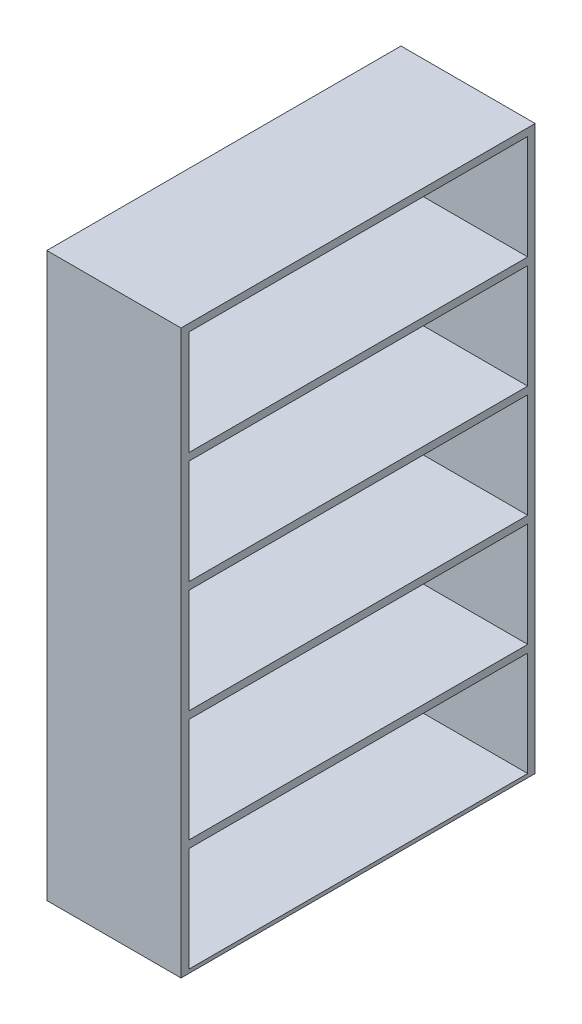
ISO-10303-21;
HEADER;
FILE_DESCRIPTION(('STEP AP214'),'2;1');
FILE_NAME('part.step','',(''),(''),'','','');
FILE_SCHEMA(('AUTOMOTIVE_DESIGN { 1 0 10303 214 1 1 1 1 }'));
ENDSEC;
DATA;
#1=APPLICATION_CONTEXT('core data for automotive mechanical design processes');
#2=APPLICATION_PROTOCOL_DEFINITION('international standard','automotive_design',2000,#1);
#3=PRODUCT_CONTEXT('',#1,'mechanical');
#4=PRODUCT('Part','Part','',(#3));
#5=PRODUCT_RELATED_PRODUCT_CATEGORY('part','',(#4));
#6=PRODUCT_DEFINITION_FORMATION('','',#4);
#7=PRODUCT_DEFINITION_CONTEXT('part definition',#1,'design');
#8=PRODUCT_DEFINITION('design','',#6,#7);
#9=PRODUCT_DEFINITION_SHAPE('','',#8);
#10=(LENGTH_UNIT() NAMED_UNIT(*) SI_UNIT(.MILLI.,.METRE.));
#11=(NAMED_UNIT(*) PLANE_ANGLE_UNIT() SI_UNIT($,.RADIAN.));
#12=(NAMED_UNIT(*) SI_UNIT($,.STERADIAN.) SOLID_ANGLE_UNIT());
#13=UNCERTAINTY_MEASURE_WITH_UNIT(LENGTH_MEASURE(1.E-05),#10,'distance_accuracy_value','');
#14=(GEOMETRIC_REPRESENTATION_CONTEXT(3) GLOBAL_UNCERTAINTY_ASSIGNED_CONTEXT((#13)) GLOBAL_UNIT_ASSIGNED_CONTEXT((#10,
#11,#12)) REPRESENTATION_CONTEXT('',''));
#15=CARTESIAN_POINT('',(0.,0.,0.));
#16=DIRECTION('',(0.,0.,1.));
#17=DIRECTION('',(1.,0.,0.));
#18=AXIS2_PLACEMENT_3D('',#15,#16,#17);
#19=CARTESIAN_POINT('',(-228.6,1917.7,603.25));
#20=DIRECTION('',(1.,0.,0.));
#21=DIRECTION('',(0.,0.,-1.));
#22=AXIS2_PLACEMENT_3D('',#19,#20,#21);
#23=PLANE('',#22);
#24=DIRECTION('',(0.,-1.,0.));
#25=VECTOR('',#24,1.);
#26=CARTESIAN_POINT('',(-228.6,1.80411241501592E-13,-577.850000000012));
#27=LINE('',#26,#25);
#28=CARTESIAN_POINT('',(-228.6,749.3,-577.850000000012));
#29=VERTEX_POINT('',#28);
#30=CARTESIAN_POINT('',(-228.6,393.7,-577.850000000012));
#31=VERTEX_POINT('',#30);
#32=EDGE_CURVE('E230',#29,#31,#27,.T.);
#33=ORIENTED_EDGE('',*,*,#32,.F.);
#34=DIRECTION('',(0.,0.,-1.));
#35=VECTOR('',#34,1.);
#36=CARTESIAN_POINT('',(-228.6,749.3,0.));
#37=LINE('',#36,#35);
#38=CARTESIAN_POINT('',(-228.6,749.3,575.309999999988));
#39=VERTEX_POINT('',#38);
#40=EDGE_CURVE('E232',#39,#29,#37,.T.);
#41=ORIENTED_EDGE('',*,*,#40,.F.);
#42=DIRECTION('',(0.,-1.,0.));
#43=VECTOR('',#42,1.);
#44=CARTESIAN_POINT('',(-228.6,0.,575.309999999988));
#45=LINE('',#44,#43);
#46=CARTESIAN_POINT('',(-228.6,393.7,575.309999999988));
#47=VERTEX_POINT('',#46);
#48=EDGE_CURVE('E235',#39,#47,#45,.T.);
#49=ORIENTED_EDGE('',*,*,#48,.T.);
#50=DIRECTION('',(0.,0.,-1.));
#51=VECTOR('',#50,1.);
#52=CARTESIAN_POINT('',(-228.6,393.7,0.));
#53=LINE('',#52,#51);
#54=EDGE_CURVE('E238',#47,#31,#53,.T.);
#55=ORIENTED_EDGE('',*,*,#54,.T.);
#56=EDGE_LOOP('',(#33,#41,#49,#55));
#57=FACE_BOUND('',#56,.T.);
#58=DIRECTION('',(0.,-1.,0.));
#59=VECTOR('',#58,1.);
#60=CARTESIAN_POINT('',(-228.6,1.80411241501589E-13,-577.850000000004));
#61=LINE('',#60,#59);
#62=CARTESIAN_POINT('',(-228.6,1511.3,-577.850000000004));
#63=VERTEX_POINT('',#62);
#64=CARTESIAN_POINT('',(-228.6,1155.7,-577.850000000004));
#65=VERTEX_POINT('',#64);
#66=EDGE_CURVE('E292',#63,#65,#61,.T.);
#67=ORIENTED_EDGE('',*,*,#66,.F.);
#68=DIRECTION('',(0.,0.,-1.));
#69=VECTOR('',#68,1.);
#70=CARTESIAN_POINT('',(-228.6,1511.3,0.));
#71=LINE('',#70,#69);
#72=CARTESIAN_POINT('',(-228.6,1511.3,575.309999999996));
#73=VERTEX_POINT('',#72);
#74=EDGE_CURVE('E294',#73,#63,#71,.T.);
#75=ORIENTED_EDGE('',*,*,#74,.F.);
#76=DIRECTION('',(0.,-1.,0.));
#77=VECTOR('',#76,1.);
#78=CARTESIAN_POINT('',(-228.6,0.,575.309999999996));
#79=LINE('',#78,#77);
#80=CARTESIAN_POINT('',(-228.6,1155.7,575.309999999996));
#81=VERTEX_POINT('',#80);
#82=EDGE_CURVE('E297',#73,#81,#79,.T.);
#83=ORIENTED_EDGE('',*,*,#82,.T.);
#84=DIRECTION('',(0.,0.,-1.));
#85=VECTOR('',#84,1.);
#86=CARTESIAN_POINT('',(-228.6,1155.7,0.));
#87=LINE('',#86,#85);
#88=EDGE_CURVE('E300',#81,#65,#87,.T.);
#89=ORIENTED_EDGE('',*,*,#88,.T.);
#90=EDGE_LOOP('',(#67,#75,#83,#89));
#91=FACE_BOUND('',#90,.T.);
#92=DIRECTION('',(0.,0.,1.));
#93=VECTOR('',#92,1.);
#94=CARTESIAN_POINT('',(-228.6,0.,603.25));
#95=LINE('',#94,#93);
#96=CARTESIAN_POINT('',(-228.6,0.,-603.25));
#97=VERTEX_POINT('',#96);
#98=CARTESIAN_POINT('',(-228.6,0.,603.25));
#99=VERTEX_POINT('',#98);
#100=EDGE_CURVE('E348',#97,#99,#95,.T.);
#101=ORIENTED_EDGE('',*,*,#100,.T.);
#102=DIRECTION('',(0.,-1.,0.));
#103=VECTOR('',#102,1.);
#104=CARTESIAN_POINT('',(-228.6,1917.7,603.25));
#105=LINE('',#104,#103);
#106=CARTESIAN_POINT('',(-228.6,1917.7,603.25));
#107=VERTEX_POINT('',#106);
#108=EDGE_CURVE('E11',#107,#99,#105,.T.);
#109=ORIENTED_EDGE('',*,*,#108,.F.);
#110=DIRECTION('',(0.,0.,1.));
#111=VECTOR('',#110,1.);
#112=CARTESIAN_POINT('',(-228.6,1917.7,603.25));
#113=LINE('',#112,#111);
#114=CARTESIAN_POINT('',(-228.6,1917.7,-603.25));
#115=VERTEX_POINT('',#114);
#116=EDGE_CURVE('E355',#115,#107,#113,.T.);
#117=ORIENTED_EDGE('',*,*,#116,.F.);
#118=DIRECTION('',(0.,-1.,0.));
#119=VECTOR('',#118,1.);
#120=CARTESIAN_POINT('',(-228.6,1917.7,-603.25));
#121=LINE('',#120,#119);
#122=EDGE_CURVE('E365',#115,#97,#121,.T.);
#123=ORIENTED_EDGE('',*,*,#122,.T.);
#124=EDGE_LOOP('',(#101,#109,#117,#123));
#125=FACE_BOUND('',#124,.T.);
#126=DIRECTION('',(0.,0.,-1.));
#127=VECTOR('',#126,1.);
#128=CARTESIAN_POINT('',(-228.6,1892.3,0.));
#129=LINE('',#128,#127);
#130=CARTESIAN_POINT('',(-228.6,1892.3,575.31));
#131=VERTEX_POINT('',#130);
#132=CARTESIAN_POINT('',(-228.6,1892.3,-577.85));
#133=VERTEX_POINT('',#132);
#134=EDGE_CURVE('E323',#131,#133,#129,.T.);
#135=ORIENTED_EDGE('',*,*,#134,.F.);
#136=DIRECTION('',(0.,-1.,0.));
#137=VECTOR('',#136,1.);
#138=CARTESIAN_POINT('',(-228.6,0.,575.31));
#139=LINE('',#138,#137);
#140=CARTESIAN_POINT('',(-228.6,1536.7,575.31));
#141=VERTEX_POINT('',#140);
#142=EDGE_CURVE('E325',#131,#141,#139,.T.);
#143=ORIENTED_EDGE('',*,*,#142,.T.);
#144=DIRECTION('',(0.,0.,-1.));
#145=VECTOR('',#144,1.);
#146=CARTESIAN_POINT('',(-228.6,1536.7,0.));
#147=LINE('',#146,#145);
#148=CARTESIAN_POINT('',(-228.6,1536.7,-577.85));
#149=VERTEX_POINT('',#148);
#150=EDGE_CURVE('E329',#141,#149,#147,.T.);
#151=ORIENTED_EDGE('',*,*,#150,.T.);
#152=DIRECTION('',(0.,-1.,0.));
#153=VECTOR('',#152,1.);
#154=CARTESIAN_POINT('',(-228.6,1.80411241501588E-13,-577.85));
#155=LINE('',#154,#153);
#156=EDGE_CURVE('E332',#133,#149,#155,.T.);
#157=ORIENTED_EDGE('',*,*,#156,.F.);
#158=EDGE_LOOP('',(#135,#143,#151,#157));
#159=FACE_BOUND('',#158,.T.);
#160=DIRECTION('',(0.,-1.,0.));
#161=VECTOR('',#160,1.);
#162=CARTESIAN_POINT('',(-228.6,1.80411241501591E-13,-577.850000000008));
#163=LINE('',#162,#161);
#164=CARTESIAN_POINT('',(-228.6,1130.3,-577.850000000008));
#165=VERTEX_POINT('',#164);
#166=CARTESIAN_POINT('',(-228.6,774.7,-577.850000000008));
#167=VERTEX_POINT('',#166);
#168=EDGE_CURVE('E261',#165,#167,#163,.T.);
#169=ORIENTED_EDGE('',*,*,#168,.F.);
#170=DIRECTION('',(0.,0.,-1.));
#171=VECTOR('',#170,1.);
#172=CARTESIAN_POINT('',(-228.6,1130.3,0.));
#173=LINE('',#172,#171);
#174=CARTESIAN_POINT('',(-228.6,1130.3,575.309999999992));
#175=VERTEX_POINT('',#174);
#176=EDGE_CURVE('E263',#175,#165,#173,.T.);
#177=ORIENTED_EDGE('',*,*,#176,.F.);
#178=DIRECTION('',(0.,-1.,0.));
#179=VECTOR('',#178,1.);
#180=CARTESIAN_POINT('',(-228.6,0.,575.309999999992));
#181=LINE('',#180,#179);
#182=CARTESIAN_POINT('',(-228.6,774.7,575.309999999992));
#183=VERTEX_POINT('',#182);
#184=EDGE_CURVE('E266',#175,#183,#181,.T.);
#185=ORIENTED_EDGE('',*,*,#184,.T.);
#186=DIRECTION('',(0.,0.,-1.));
#187=VECTOR('',#186,1.);
#188=CARTESIAN_POINT('',(-228.6,774.7,0.));
#189=LINE('',#188,#187);
#190=EDGE_CURVE('E269',#183,#167,#189,.T.);
#191=ORIENTED_EDGE('',*,*,#190,.T.);
#192=EDGE_LOOP('',(#169,#177,#185,#191));
#193=FACE_BOUND('',#192,.T.);
#194=DIRECTION('',(0.,-1.,0.));
#195=VECTOR('',#194,1.);
#196=CARTESIAN_POINT('',(-228.6,1.80411241501593E-13,-577.850000000016));
#197=LINE('',#196,#195);
#198=CARTESIAN_POINT('',(-228.6,368.3,-577.850000000016));
#199=VERTEX_POINT('',#198);
#200=CARTESIAN_POINT('',(-228.6,12.6999999999999,-577.850000000016));
#201=VERTEX_POINT('',#200);
#202=EDGE_CURVE('E203',#199,#201,#197,.T.);
#203=ORIENTED_EDGE('',*,*,#202,.F.);
#204=DIRECTION('',(0.,0.,-1.));
#205=VECTOR('',#204,1.);
#206=CARTESIAN_POINT('',(-228.6,368.3,0.));
#207=LINE('',#206,#205);
#208=CARTESIAN_POINT('',(-228.6,368.3,575.309999999984));
#209=VERTEX_POINT('',#208);
#210=EDGE_CURVE('E195',#209,#199,#207,.T.);
#211=ORIENTED_EDGE('',*,*,#210,.F.);
#212=DIRECTION('',(0.,-1.,0.));
#213=VECTOR('',#212,1.);
#214=CARTESIAN_POINT('',(-228.6,0.,575.309999999984));
#215=LINE('',#214,#213);
#216=CARTESIAN_POINT('',(-228.6,12.6999999999999,575.309999999984));
#217=VERTEX_POINT('',#216);
#218=EDGE_CURVE('E49',#209,#217,#215,.T.);
#219=ORIENTED_EDGE('',*,*,#218,.T.);
#220=DIRECTION('',(0.,0.,-1.));
#221=VECTOR('',#220,1.);
#222=CARTESIAN_POINT('',(-228.6,12.6999999999999,0.));
#223=LINE('',#222,#221);
#224=EDGE_CURVE('E207',#217,#201,#223,.T.);
#225=ORIENTED_EDGE('',*,*,#224,.T.);
#226=EDGE_LOOP('',(#203,#211,#219,#225));
#227=FACE_BOUND('',#226,.T.);
#228=ADVANCED_FACE('F35',(#57,#91,#125,#159,#193,#227),#23,.F.);
#229=CARTESIAN_POINT('',(228.6,1917.7,603.25));
#230=DIRECTION('',(-1.,0.,0.));
#231=DIRECTION('',(0.,0.,1.));
#232=AXIS2_PLACEMENT_3D('',#229,#230,#231);
#233=PLANE('',#232);
#234=DIRECTION('',(0.,-1.,0.));
#235=VECTOR('',#234,1.);
#236=CARTESIAN_POINT('',(228.6,1.80411241501592E-13,-577.850000000012));
#237=LINE('',#236,#235);
#238=CARTESIAN_POINT('',(228.6,749.3,-577.850000000012));
#239=VERTEX_POINT('',#238);
#240=CARTESIAN_POINT('',(228.6,393.7,-577.850000000012));
#241=VERTEX_POINT('',#240);
#242=EDGE_CURVE('E226',#239,#241,#237,.T.);
#243=ORIENTED_EDGE('',*,*,#242,.T.);
#244=DIRECTION('',(0.,0.,-1.));
#245=VECTOR('',#244,1.);
#246=CARTESIAN_POINT('',(228.6,393.7,0.));
#247=LINE('',#246,#245);
#248=CARTESIAN_POINT('',(228.6,393.7,575.309999999988));
#249=VERTEX_POINT('',#248);
#250=EDGE_CURVE('E233',#249,#241,#247,.T.);
#251=ORIENTED_EDGE('',*,*,#250,.F.);
#252=DIRECTION('',(0.,-1.,0.));
#253=VECTOR('',#252,1.);
#254=CARTESIAN_POINT('',(228.6,0.,575.309999999988));
#255=LINE('',#254,#253);
#256=CARTESIAN_POINT('',(228.6,749.3,575.309999999988));
#257=VERTEX_POINT('',#256);
#258=EDGE_CURVE('E247',#257,#249,#255,.T.);
#259=ORIENTED_EDGE('',*,*,#258,.F.);
#260=DIRECTION('',(0.,0.,-1.));
#261=VECTOR('',#260,1.);
#262=CARTESIAN_POINT('',(228.6,749.3,0.));
#263=LINE('',#262,#261);
#264=EDGE_CURVE('E244',#257,#239,#263,.T.);
#265=ORIENTED_EDGE('',*,*,#264,.T.);
#266=EDGE_LOOP('',(#243,#251,#259,#265));
#267=FACE_BOUND('',#266,.T.);
#268=DIRECTION('',(0.,-1.,0.));
#269=VECTOR('',#268,1.);
#270=CARTESIAN_POINT('',(228.6,1.80411241501589E-13,-577.850000000004));
#271=LINE('',#270,#269);
#272=CARTESIAN_POINT('',(228.6,1511.3,-577.850000000004));
#273=VERTEX_POINT('',#272);
#274=CARTESIAN_POINT('',(228.6,1155.7,-577.850000000004));
#275=VERTEX_POINT('',#274);
#276=EDGE_CURVE('E285',#273,#275,#271,.T.);
#277=ORIENTED_EDGE('',*,*,#276,.T.);
#278=DIRECTION('',(0.,0.,-1.));
#279=VECTOR('',#278,1.);
#280=CARTESIAN_POINT('',(228.6,1155.7,0.));
#281=LINE('',#280,#279);
#282=CARTESIAN_POINT('',(228.6,1155.7,575.309999999996));
#283=VERTEX_POINT('',#282);
#284=EDGE_CURVE('E295',#283,#275,#281,.T.);
#285=ORIENTED_EDGE('',*,*,#284,.F.);
#286=DIRECTION('',(0.,-1.,0.));
#287=VECTOR('',#286,1.);
#288=CARTESIAN_POINT('',(228.6,0.,575.309999999996));
#289=LINE('',#288,#287);
#290=CARTESIAN_POINT('',(228.6,1511.3,575.309999999996));
#291=VERTEX_POINT('',#290);
#292=EDGE_CURVE('E309',#291,#283,#289,.T.);
#293=ORIENTED_EDGE('',*,*,#292,.F.);
#294=DIRECTION('',(0.,0.,-1.));
#295=VECTOR('',#294,1.);
#296=CARTESIAN_POINT('',(228.6,1511.3,0.));
#297=LINE('',#296,#295);
#298=EDGE_CURVE('E306',#291,#273,#297,.T.);
#299=ORIENTED_EDGE('',*,*,#298,.T.);
#300=EDGE_LOOP('',(#277,#285,#293,#299));
#301=FACE_BOUND('',#300,.T.);
#302=DIRECTION('',(0.,0.,-1.));
#303=VECTOR('',#302,1.);
#304=CARTESIAN_POINT('',(228.6,0.,603.25));
#305=LINE('',#304,#303);
#306=CARTESIAN_POINT('',(228.6,0.,603.25));
#307=VERTEX_POINT('',#306);
#308=CARTESIAN_POINT('',(228.6,0.,-603.25));
#309=VERTEX_POINT('',#308);
#310=EDGE_CURVE('E370',#307,#309,#305,.T.);
#311=ORIENTED_EDGE('',*,*,#310,.T.);
#312=DIRECTION('',(0.,-1.,0.));
#313=VECTOR('',#312,1.);
#314=CARTESIAN_POINT('',(228.6,1917.7,-603.25));
#315=LINE('',#314,#313);
#316=CARTESIAN_POINT('',(228.6,1917.7,-603.25));
#317=VERTEX_POINT('',#316);
#318=EDGE_CURVE('E375',#317,#309,#315,.T.);
#319=ORIENTED_EDGE('',*,*,#318,.F.);
#320=DIRECTION('',(0.,0.,-1.));
#321=VECTOR('',#320,1.);
#322=CARTESIAN_POINT('',(228.6,1917.7,603.25));
#323=LINE('',#322,#321);
#324=CARTESIAN_POINT('',(228.6,1917.7,603.25));
#325=VERTEX_POINT('',#324);
#326=EDGE_CURVE('E361',#325,#317,#323,.T.);
#327=ORIENTED_EDGE('',*,*,#326,.F.);
#328=DIRECTION('',(0.,-1.,0.));
#329=VECTOR('',#328,1.);
#330=CARTESIAN_POINT('',(228.6,1917.7,603.25));
#331=LINE('',#330,#329);
#332=EDGE_CURVE('E42',#325,#307,#331,.T.);
#333=ORIENTED_EDGE('',*,*,#332,.T.);
#334=EDGE_LOOP('',(#311,#319,#327,#333));
#335=FACE_BOUND('',#334,.T.);
#336=DIRECTION('',(0.,0.,-1.));
#337=VECTOR('',#336,1.);
#338=CARTESIAN_POINT('',(228.6,1892.3,0.));
#339=LINE('',#338,#337);
#340=CARTESIAN_POINT('',(228.6,1892.3,575.31));
#341=VERTEX_POINT('',#340);
#342=CARTESIAN_POINT('',(228.6,1892.3,-577.85));
#343=VERTEX_POINT('',#342);
#344=EDGE_CURVE('E316',#341,#343,#339,.T.);
#345=ORIENTED_EDGE('',*,*,#344,.T.);
#346=DIRECTION('',(0.,-1.,0.));
#347=VECTOR('',#346,1.);
#348=CARTESIAN_POINT('',(228.6,1.80411241501588E-13,-577.85));
#349=LINE('',#348,#347);
#350=CARTESIAN_POINT('',(228.6,1536.7,-577.85));
#351=VERTEX_POINT('',#350);
#352=EDGE_CURVE('E326',#343,#351,#349,.T.);
#353=ORIENTED_EDGE('',*,*,#352,.T.);
#354=DIRECTION('',(0.,0.,-1.));
#355=VECTOR('',#354,1.);
#356=CARTESIAN_POINT('',(228.6,1536.7,0.));
#357=LINE('',#356,#355);
#358=CARTESIAN_POINT('',(228.6,1536.7,575.31));
#359=VERTEX_POINT('',#358);
#360=EDGE_CURVE('E340',#359,#351,#357,.T.);
#361=ORIENTED_EDGE('',*,*,#360,.F.);
#362=DIRECTION('',(0.,-1.,0.));
#363=VECTOR('',#362,1.);
#364=CARTESIAN_POINT('',(228.6,0.,575.31));
#365=LINE('',#364,#363);
#366=EDGE_CURVE('E337',#341,#359,#365,.T.);
#367=ORIENTED_EDGE('',*,*,#366,.F.);
#368=EDGE_LOOP('',(#345,#353,#361,#367));
#369=FACE_BOUND('',#368,.T.);
#370=DIRECTION('',(0.,-1.,0.));
#371=VECTOR('',#370,1.);
#372=CARTESIAN_POINT('',(228.6,1.80411241501591E-13,-577.850000000008));
#373=LINE('',#372,#371);
#374=CARTESIAN_POINT('',(228.6,1130.3,-577.850000000008));
#375=VERTEX_POINT('',#374);
#376=CARTESIAN_POINT('',(228.6,774.7,-577.850000000008));
#377=VERTEX_POINT('',#376);
#378=EDGE_CURVE('E254',#375,#377,#373,.T.);
#379=ORIENTED_EDGE('',*,*,#378,.T.);
#380=DIRECTION('',(0.,0.,-1.));
#381=VECTOR('',#380,1.);
#382=CARTESIAN_POINT('',(228.6,774.7,0.));
#383=LINE('',#382,#381);
#384=CARTESIAN_POINT('',(228.6,774.7,575.309999999992));
#385=VERTEX_POINT('',#384);
#386=EDGE_CURVE('E264',#385,#377,#383,.T.);
#387=ORIENTED_EDGE('',*,*,#386,.F.);
#388=DIRECTION('',(0.,-1.,0.));
#389=VECTOR('',#388,1.);
#390=CARTESIAN_POINT('',(228.6,0.,575.309999999992));
#391=LINE('',#390,#389);
#392=CARTESIAN_POINT('',(228.6,1130.3,575.309999999992));
#393=VERTEX_POINT('',#392);
#394=EDGE_CURVE('E278',#393,#385,#391,.T.);
#395=ORIENTED_EDGE('',*,*,#394,.F.);
#396=DIRECTION('',(0.,0.,-1.));
#397=VECTOR('',#396,1.);
#398=CARTESIAN_POINT('',(228.6,1130.3,0.));
#399=LINE('',#398,#397);
#400=EDGE_CURVE('E275',#393,#375,#399,.T.);
#401=ORIENTED_EDGE('',*,*,#400,.T.);
#402=EDGE_LOOP('',(#379,#387,#395,#401));
#403=FACE_BOUND('',#402,.T.);
#404=DIRECTION('',(0.,-1.,0.));
#405=VECTOR('',#404,1.);
#406=CARTESIAN_POINT('',(228.6,1.80411241501593E-13,-577.850000000016));
#407=LINE('',#406,#405);
#408=CARTESIAN_POINT('',(228.6,368.3,-577.850000000016));
#409=VERTEX_POINT('',#408);
#410=CARTESIAN_POINT('',(228.6,12.6999999999999,-577.850000000016));
#411=VERTEX_POINT('',#410);
#412=EDGE_CURVE('E57',#409,#411,#407,.T.);
#413=ORIENTED_EDGE('',*,*,#412,.T.);
#414=DIRECTION('',(0.,0.,-1.));
#415=VECTOR('',#414,1.);
#416=CARTESIAN_POINT('',(228.6,12.6999999999999,0.));
#417=LINE('',#416,#415);
#418=CARTESIAN_POINT('',(228.6,12.6999999999999,575.309999999984));
#419=VERTEX_POINT('',#418);
#420=EDGE_CURVE('E211',#419,#411,#417,.T.);
#421=ORIENTED_EDGE('',*,*,#420,.F.);
#422=DIRECTION('',(0.,-1.,0.));
#423=VECTOR('',#422,1.);
#424=CARTESIAN_POINT('',(228.6,0.,575.309999999984));
#425=LINE('',#424,#423);
#426=CARTESIAN_POINT('',(228.6,368.3,575.309999999984));
#427=VERTEX_POINT('',#426);
#428=EDGE_CURVE('E214',#427,#419,#425,.T.);
#429=ORIENTED_EDGE('',*,*,#428,.F.);
#430=DIRECTION('',(0.,0.,-1.));
#431=VECTOR('',#430,1.);
#432=CARTESIAN_POINT('',(228.6,368.3,0.));
#433=LINE('',#432,#431);
#434=EDGE_CURVE('E220',#427,#409,#433,.T.);
#435=ORIENTED_EDGE('',*,*,#434,.T.);
#436=EDGE_LOOP('',(#413,#421,#429,#435));
#437=FACE_BOUND('',#436,.T.);
#438=ADVANCED_FACE('F382',(#267,#301,#335,#369,#403,#437),#233,.F.);
#439=CARTESIAN_POINT('',(228.6,1917.7,603.25));
#440=DIRECTION('',(0.,0.,-1.));
#441=DIRECTION('',(-1.,0.,0.));
#442=AXIS2_PLACEMENT_3D('',#439,#440,#441);
#443=PLANE('',#442);
#444=DIRECTION('',(1.,0.,0.));
#445=VECTOR('',#444,1.);
#446=CARTESIAN_POINT('',(228.6,0.,603.25));
#447=LINE('',#446,#445);
#448=EDGE_CURVE('E368',#99,#307,#447,.T.);
#449=ORIENTED_EDGE('',*,*,#448,.T.);
#450=ORIENTED_EDGE('',*,*,#332,.F.);
#451=DIRECTION('',(1.,0.,0.));
#452=VECTOR('',#451,1.);
#453=CARTESIAN_POINT('',(228.6,1917.7,603.25));
#454=LINE('',#453,#452);
#455=EDGE_CURVE('E358',#107,#325,#454,.T.);
#456=ORIENTED_EDGE('',*,*,#455,.F.);
#457=ORIENTED_EDGE('',*,*,#108,.T.);
#458=EDGE_LOOP('',(#449,#450,#456,#457));
#459=FACE_BOUND('',#458,.T.);
#460=ADVANCED_FACE('F400',(#459),#443,.F.);
#461=CARTESIAN_POINT('',(228.6,1917.7,-603.25));
#462=DIRECTION('',(0.,0.,1.));
#463=DIRECTION('',(1.,0.,0.));
#464=AXIS2_PLACEMENT_3D('',#461,#462,#463);
#465=PLANE('',#464);
#466=DIRECTION('',(-1.,0.,0.));
#467=VECTOR('',#466,1.);
#468=CARTESIAN_POINT('',(228.6,0.,-603.25));
#469=LINE('',#468,#467);
#470=EDGE_CURVE('E359',#309,#97,#469,.T.);
#471=ORIENTED_EDGE('',*,*,#470,.T.);
#472=ORIENTED_EDGE('',*,*,#122,.F.);
#473=DIRECTION('',(-1.,0.,0.));
#474=VECTOR('',#473,1.);
#475=CARTESIAN_POINT('',(228.6,1917.7,-603.25));
#476=LINE('',#475,#474);
#477=EDGE_CURVE('E363',#317,#115,#476,.T.);
#478=ORIENTED_EDGE('',*,*,#477,.F.);
#479=ORIENTED_EDGE('',*,*,#318,.T.);
#480=EDGE_LOOP('',(#471,#472,#478,#479));
#481=FACE_BOUND('',#480,.T.);
#482=ADVANCED_FACE('F392',(#481),#465,.F.);
#483=CARTESIAN_POINT('',(0.,1917.7,0.));
#484=DIRECTION('',(0.,1.,0.));
#485=DIRECTION('',(0.,0.,1.));
#486=AXIS2_PLACEMENT_3D('',#483,#484,#485);
#487=PLANE('',#486);
#488=ORIENTED_EDGE('',*,*,#116,.T.);
#489=ORIENTED_EDGE('',*,*,#455,.T.);
#490=ORIENTED_EDGE('',*,*,#326,.T.);
#491=ORIENTED_EDGE('',*,*,#477,.T.);
#492=EDGE_LOOP('',(#488,#489,#490,#491));
#493=FACE_BOUND('',#492,.T.);
#494=ADVANCED_FACE('F399',(#493),#487,.T.);
#495=CARTESIAN_POINT('',(0.,0.,0.));
#496=DIRECTION('',(0.,1.,0.));
#497=DIRECTION('',(0.,0.,1.));
#498=AXIS2_PLACEMENT_3D('',#495,#496,#497);
#499=PLANE('',#498);
#500=ORIENTED_EDGE('',*,*,#100,.F.);
#501=ORIENTED_EDGE('',*,*,#470,.F.);
#502=ORIENTED_EDGE('',*,*,#310,.F.);
#503=ORIENTED_EDGE('',*,*,#448,.F.);
#504=EDGE_LOOP('',(#500,#501,#502,#503));
#505=FACE_BOUND('',#504,.T.);
#506=ADVANCED_FACE('F389',(#505),#499,.F.);
#507=CARTESIAN_POINT('',(-228.6,1892.3,0.));
#508=DIRECTION('',(0.,-1.,0.));
#509=DIRECTION('',(0.,0.,-1.));
#510=AXIS2_PLACEMENT_3D('',#507,#508,#509);
#511=PLANE('',#510);
#512=ORIENTED_EDGE('',*,*,#344,.F.);
#513=DIRECTION('',(1.,0.,0.));
#514=VECTOR('',#513,1.);
#515=CARTESIAN_POINT('',(-228.6,1892.3,575.31));
#516=LINE('',#515,#514);
#517=EDGE_CURVE('E334',#131,#341,#516,.T.);
#518=ORIENTED_EDGE('',*,*,#517,.F.);
#519=ORIENTED_EDGE('',*,*,#134,.T.);
#520=DIRECTION('',(1.,0.,0.));
#521=VECTOR('',#520,1.);
#522=CARTESIAN_POINT('',(-228.6,1892.3,-577.85));
#523=LINE('',#522,#521);
#524=EDGE_CURVE('E345',#133,#343,#523,.T.);
#525=ORIENTED_EDGE('',*,*,#524,.T.);
#526=EDGE_LOOP('',(#512,#518,#519,#525));
#527=FACE_BOUND('',#526,.T.);
#528=ADVANCED_FACE('F452',(#527),#511,.T.);
#529=CARTESIAN_POINT('',(-228.6,1.80411241501588E-13,-577.85));
#530=DIRECTION('',(0.,0.,1.));
#531=DIRECTION('',(0.,-1.,0.));
#532=AXIS2_PLACEMENT_3D('',#529,#530,#531);
#533=PLANE('',#532);
#534=ORIENTED_EDGE('',*,*,#352,.F.);
#535=ORIENTED_EDGE('',*,*,#524,.F.);
#536=ORIENTED_EDGE('',*,*,#156,.T.);
#537=DIRECTION('',(1.,0.,0.));
#538=VECTOR('',#537,1.);
#539=CARTESIAN_POINT('',(-228.6,1536.7,-577.85));
#540=LINE('',#539,#538);
#541=EDGE_CURVE('E349',#149,#351,#540,.T.);
#542=ORIENTED_EDGE('',*,*,#541,.T.);
#543=EDGE_LOOP('',(#534,#535,#536,#542));
#544=FACE_BOUND('',#543,.T.);
#545=ADVANCED_FACE('F448',(#544),#533,.T.);
#546=CARTESIAN_POINT('',(-228.6,1536.7,0.));
#547=DIRECTION('',(0.,-1.,0.));
#548=DIRECTION('',(0.,0.,-1.));
#549=AXIS2_PLACEMENT_3D('',#546,#547,#548);
#550=PLANE('',#549);
#551=ORIENTED_EDGE('',*,*,#360,.T.);
#552=ORIENTED_EDGE('',*,*,#541,.F.);
#553=ORIENTED_EDGE('',*,*,#150,.F.);
#554=DIRECTION('',(1.,0.,0.));
#555=VECTOR('',#554,1.);
#556=CARTESIAN_POINT('',(-228.6,1536.7,575.31));
#557=LINE('',#556,#555);
#558=EDGE_CURVE('E351',#141,#359,#557,.T.);
#559=ORIENTED_EDGE('',*,*,#558,.T.);
#560=EDGE_LOOP('',(#551,#552,#553,#559));
#561=FACE_BOUND('',#560,.T.);
#562=ADVANCED_FACE('F451',(#561),#550,.F.);
#563=CARTESIAN_POINT('',(-228.6,0.,575.31));
#564=DIRECTION('',(0.,0.,1.));
#565=DIRECTION('',(1.,0.,0.));
#566=AXIS2_PLACEMENT_3D('',#563,#564,#565);
#567=PLANE('',#566);
#568=ORIENTED_EDGE('',*,*,#366,.T.);
#569=ORIENTED_EDGE('',*,*,#558,.F.);
#570=ORIENTED_EDGE('',*,*,#142,.F.);
#571=ORIENTED_EDGE('',*,*,#517,.T.);
#572=EDGE_LOOP('',(#568,#569,#570,#571));
#573=FACE_BOUND('',#572,.T.);
#574=ADVANCED_FACE('F447',(#573),#567,.F.);
#575=CARTESIAN_POINT('',(-228.6,1.80411241501589E-13,-577.850000000004));
#576=DIRECTION('',(0.,0.,1.));
#577=DIRECTION('',(0.,-1.,0.));
#578=AXIS2_PLACEMENT_3D('',#575,#576,#577);
#579=PLANE('',#578);
#580=ORIENTED_EDGE('',*,*,#276,.F.);
#581=DIRECTION('',(1.,0.,0.));
#582=VECTOR('',#581,1.);
#583=CARTESIAN_POINT('',(-228.6,1511.3,-577.850000000004));
#584=LINE('',#583,#582);
#585=EDGE_CURVE('E303',#63,#273,#584,.T.);
#586=ORIENTED_EDGE('',*,*,#585,.F.);
#587=ORIENTED_EDGE('',*,*,#66,.T.);
#588=DIRECTION('',(1.,0.,0.));
#589=VECTOR('',#588,1.);
#590=CARTESIAN_POINT('',(-228.6,1155.7,-577.850000000004));
#591=LINE('',#590,#589);
#592=EDGE_CURVE('E314',#65,#275,#591,.T.);
#593=ORIENTED_EDGE('',*,*,#592,.T.);
#594=EDGE_LOOP('',(#580,#586,#587,#593));
#595=FACE_BOUND('',#594,.T.);
#596=ADVANCED_FACE('F422',(#595),#579,.T.);
#597=CARTESIAN_POINT('',(-228.6,1155.7,0.));
#598=DIRECTION('',(0.,-1.,0.));
#599=DIRECTION('',(0.,0.,-1.));
#600=AXIS2_PLACEMENT_3D('',#597,#598,#599);
#601=PLANE('',#600);
#602=ORIENTED_EDGE('',*,*,#284,.T.);
#603=ORIENTED_EDGE('',*,*,#592,.F.);
#604=ORIENTED_EDGE('',*,*,#88,.F.);
#605=DIRECTION('',(1.,0.,0.));
#606=VECTOR('',#605,1.);
#607=CARTESIAN_POINT('',(-228.6,1155.7,575.309999999996));
#608=LINE('',#607,#606);
#609=EDGE_CURVE('E317',#81,#283,#608,.T.);
#610=ORIENTED_EDGE('',*,*,#609,.T.);
#611=EDGE_LOOP('',(#602,#603,#604,#610));
#612=FACE_BOUND('',#611,.T.);
#613=ADVANCED_FACE('F424',(#612),#601,.F.);
#614=CARTESIAN_POINT('',(-228.6,0.,575.309999999996));
#615=DIRECTION('',(0.,0.,1.));
#616=DIRECTION('',(1.,0.,0.));
#617=AXIS2_PLACEMENT_3D('',#614,#615,#616);
#618=PLANE('',#617);
#619=ORIENTED_EDGE('',*,*,#292,.T.);
#620=ORIENTED_EDGE('',*,*,#609,.F.);
#621=ORIENTED_EDGE('',*,*,#82,.F.);
#622=DIRECTION('',(1.,0.,0.));
#623=VECTOR('',#622,1.);
#624=CARTESIAN_POINT('',(-228.6,1511.3,575.309999999996));
#625=LINE('',#624,#623);
#626=EDGE_CURVE('E319',#73,#291,#625,.T.);
#627=ORIENTED_EDGE('',*,*,#626,.T.);
#628=EDGE_LOOP('',(#619,#620,#621,#627));
#629=FACE_BOUND('',#628,.T.);
#630=ADVANCED_FACE('F433',(#629),#618,.F.);
#631=CARTESIAN_POINT('',(-228.6,1511.3,0.));
#632=DIRECTION('',(0.,-1.,0.));
#633=DIRECTION('',(0.,0.,-1.));
#634=AXIS2_PLACEMENT_3D('',#631,#632,#633);
#635=PLANE('',#634);
#636=ORIENTED_EDGE('',*,*,#298,.F.);
#637=ORIENTED_EDGE('',*,*,#626,.F.);
#638=ORIENTED_EDGE('',*,*,#74,.T.);
#639=ORIENTED_EDGE('',*,*,#585,.T.);
#640=EDGE_LOOP('',(#636,#637,#638,#639));
#641=FACE_BOUND('',#640,.T.);
#642=ADVANCED_FACE('F430',(#641),#635,.T.);
#643=CARTESIAN_POINT('',(-228.6,1.80411241501591E-13,-577.850000000008));
#644=DIRECTION('',(0.,0.,1.));
#645=DIRECTION('',(0.,-1.,0.));
#646=AXIS2_PLACEMENT_3D('',#643,#644,#645);
#647=PLANE('',#646);
#648=ORIENTED_EDGE('',*,*,#378,.F.);
#649=DIRECTION('',(1.,0.,0.));
#650=VECTOR('',#649,1.);
#651=CARTESIAN_POINT('',(-228.6,1130.3,-577.850000000008));
#652=LINE('',#651,#650);
#653=EDGE_CURVE('E272',#165,#375,#652,.T.);
#654=ORIENTED_EDGE('',*,*,#653,.F.);
#655=ORIENTED_EDGE('',*,*,#168,.T.);
#656=DIRECTION('',(1.,0.,0.));
#657=VECTOR('',#656,1.);
#658=CARTESIAN_POINT('',(-228.6,774.7,-577.850000000008));
#659=LINE('',#658,#657);
#660=EDGE_CURVE('E283',#167,#377,#659,.T.);
#661=ORIENTED_EDGE('',*,*,#660,.T.);
#662=EDGE_LOOP('',(#648,#654,#655,#661));
#663=FACE_BOUND('',#662,.T.);
#664=ADVANCED_FACE('F440',(#663),#647,.T.);
#665=CARTESIAN_POINT('',(-228.6,774.7,0.));
#666=DIRECTION('',(0.,-1.,0.));
#667=DIRECTION('',(0.,0.,-1.));
#668=AXIS2_PLACEMENT_3D('',#665,#666,#667);
#669=PLANE('',#668);
#670=ORIENTED_EDGE('',*,*,#386,.T.);
#671=ORIENTED_EDGE('',*,*,#660,.F.);
#672=ORIENTED_EDGE('',*,*,#190,.F.);
#673=DIRECTION('',(1.,0.,0.));
#674=VECTOR('',#673,1.);
#675=CARTESIAN_POINT('',(-228.6,774.7,575.309999999992));
#676=LINE('',#675,#674);
#677=EDGE_CURVE('E286',#183,#385,#676,.T.);
#678=ORIENTED_EDGE('',*,*,#677,.T.);
#679=EDGE_LOOP('',(#670,#671,#672,#678));
#680=FACE_BOUND('',#679,.T.);
#681=ADVANCED_FACE('F516',(#680),#669,.F.);
#682=CARTESIAN_POINT('',(-228.6,0.,575.309999999992));
#683=DIRECTION('',(0.,0.,1.));
#684=DIRECTION('',(1.,0.,0.));
#685=AXIS2_PLACEMENT_3D('',#682,#683,#684);
#686=PLANE('',#685);
#687=ORIENTED_EDGE('',*,*,#394,.T.);
#688=ORIENTED_EDGE('',*,*,#677,.F.);
#689=ORIENTED_EDGE('',*,*,#184,.F.);
#690=DIRECTION('',(1.,0.,0.));
#691=VECTOR('',#690,1.);
#692=CARTESIAN_POINT('',(-228.6,1130.3,575.309999999992));
#693=LINE('',#692,#691);
#694=EDGE_CURVE('E288',#175,#393,#693,.T.);
#695=ORIENTED_EDGE('',*,*,#694,.T.);
#696=EDGE_LOOP('',(#687,#688,#689,#695));
#697=FACE_BOUND('',#696,.T.);
#698=ADVANCED_FACE('F526',(#697),#686,.F.);
#699=CARTESIAN_POINT('',(-228.6,1130.3,0.));
#700=DIRECTION('',(0.,-1.,0.));
#701=DIRECTION('',(0.,0.,-1.));
#702=AXIS2_PLACEMENT_3D('',#699,#700,#701);
#703=PLANE('',#702);
#704=ORIENTED_EDGE('',*,*,#400,.F.);
#705=ORIENTED_EDGE('',*,*,#694,.F.);
#706=ORIENTED_EDGE('',*,*,#176,.T.);
#707=ORIENTED_EDGE('',*,*,#653,.T.);
#708=EDGE_LOOP('',(#704,#705,#706,#707));
#709=FACE_BOUND('',#708,.T.);
#710=ADVANCED_FACE('F536',(#709),#703,.T.);
#711=CARTESIAN_POINT('',(-228.6,1.80411241501592E-13,-577.850000000012));
#712=DIRECTION('',(0.,0.,1.));
#713=DIRECTION('',(0.,-1.,0.));
#714=AXIS2_PLACEMENT_3D('',#711,#712,#713);
#715=PLANE('',#714);
#716=ORIENTED_EDGE('',*,*,#242,.F.);
#717=DIRECTION('',(1.,0.,0.));
#718=VECTOR('',#717,1.);
#719=CARTESIAN_POINT('',(-228.6,749.3,-577.850000000012));
#720=LINE('',#719,#718);
#721=EDGE_CURVE('E241',#29,#239,#720,.T.);
#722=ORIENTED_EDGE('',*,*,#721,.F.);
#723=ORIENTED_EDGE('',*,*,#32,.T.);
#724=DIRECTION('',(1.,0.,0.));
#725=VECTOR('',#724,1.);
#726=CARTESIAN_POINT('',(-228.6,393.7,-577.850000000012));
#727=LINE('',#726,#725);
#728=EDGE_CURVE('E252',#31,#241,#727,.T.);
#729=ORIENTED_EDGE('',*,*,#728,.T.);
#730=EDGE_LOOP('',(#716,#722,#723,#729));
#731=FACE_BOUND('',#730,.T.);
#732=ADVANCED_FACE('F547',(#731),#715,.T.);
#733=CARTESIAN_POINT('',(-228.6,393.7,0.));
#734=DIRECTION('',(0.,-1.,0.));
#735=DIRECTION('',(0.,0.,-1.));
#736=AXIS2_PLACEMENT_3D('',#733,#734,#735);
#737=PLANE('',#736);
#738=ORIENTED_EDGE('',*,*,#250,.T.);
#739=ORIENTED_EDGE('',*,*,#728,.F.);
#740=ORIENTED_EDGE('',*,*,#54,.F.);
#741=DIRECTION('',(1.,0.,0.));
#742=VECTOR('',#741,1.);
#743=CARTESIAN_POINT('',(-228.6,393.7,575.309999999988));
#744=LINE('',#743,#742);
#745=EDGE_CURVE('E255',#47,#249,#744,.T.);
#746=ORIENTED_EDGE('',*,*,#745,.T.);
#747=EDGE_LOOP('',(#738,#739,#740,#746));
#748=FACE_BOUND('',#747,.T.);
#749=ADVANCED_FACE('F557',(#748),#737,.F.);
#750=CARTESIAN_POINT('',(-228.6,0.,575.309999999988));
#751=DIRECTION('',(0.,0.,1.));
#752=DIRECTION('',(1.,0.,0.));
#753=AXIS2_PLACEMENT_3D('',#750,#751,#752);
#754=PLANE('',#753);
#755=ORIENTED_EDGE('',*,*,#258,.T.);
#756=ORIENTED_EDGE('',*,*,#745,.F.);
#757=ORIENTED_EDGE('',*,*,#48,.F.);
#758=DIRECTION('',(1.,0.,0.));
#759=VECTOR('',#758,1.);
#760=CARTESIAN_POINT('',(-228.6,749.3,575.309999999988));
#761=LINE('',#760,#759);
#762=EDGE_CURVE('E257',#39,#257,#761,.T.);
#763=ORIENTED_EDGE('',*,*,#762,.T.);
#764=EDGE_LOOP('',(#755,#756,#757,#763));
#765=FACE_BOUND('',#764,.T.);
#766=ADVANCED_FACE('F568',(#765),#754,.F.);
#767=CARTESIAN_POINT('',(-228.6,749.3,0.));
#768=DIRECTION('',(0.,-1.,0.));
#769=DIRECTION('',(0.,0.,-1.));
#770=AXIS2_PLACEMENT_3D('',#767,#768,#769);
#771=PLANE('',#770);
#772=ORIENTED_EDGE('',*,*,#264,.F.);
#773=ORIENTED_EDGE('',*,*,#762,.F.);
#774=ORIENTED_EDGE('',*,*,#40,.T.);
#775=ORIENTED_EDGE('',*,*,#721,.T.);
#776=EDGE_LOOP('',(#772,#773,#774,#775));
#777=FACE_BOUND('',#776,.T.);
#778=ADVANCED_FACE('F578',(#777),#771,.T.);
#779=CARTESIAN_POINT('',(-228.6,1.80411241501593E-13,-577.850000000016));
#780=DIRECTION('',(0.,0.,1.));
#781=DIRECTION('',(0.,-1.,0.));
#782=AXIS2_PLACEMENT_3D('',#779,#780,#781);
#783=PLANE('',#782);
#784=ORIENTED_EDGE('',*,*,#412,.F.);
#785=DIRECTION('',(1.,0.,0.));
#786=VECTOR('',#785,1.);
#787=CARTESIAN_POINT('',(-228.6,368.3,-577.850000000016));
#788=LINE('',#787,#786);
#789=EDGE_CURVE('E198',#199,#409,#788,.T.);
#790=ORIENTED_EDGE('',*,*,#789,.F.);
#791=ORIENTED_EDGE('',*,*,#202,.T.);
#792=DIRECTION('',(1.,0.,0.));
#793=VECTOR('',#792,1.);
#794=CARTESIAN_POINT('',(-228.6,12.6999999999999,-577.850000000016));
#795=LINE('',#794,#793);
#796=EDGE_CURVE('E224',#201,#411,#795,.T.);
#797=ORIENTED_EDGE('',*,*,#796,.T.);
#798=EDGE_LOOP('',(#784,#790,#791,#797));
#799=FACE_BOUND('',#798,.T.);
#800=ADVANCED_FACE('F205',(#799),#783,.T.);
#801=CARTESIAN_POINT('',(-228.6,12.6999999999999,0.));
#802=DIRECTION('',(0.,-1.,0.));
#803=DIRECTION('',(0.,0.,-1.));
#804=AXIS2_PLACEMENT_3D('',#801,#802,#803);
#805=PLANE('',#804);
#806=ORIENTED_EDGE('',*,*,#420,.T.);
#807=ORIENTED_EDGE('',*,*,#796,.F.);
#808=ORIENTED_EDGE('',*,*,#224,.F.);
#809=DIRECTION('',(1.,0.,0.));
#810=VECTOR('',#809,1.);
#811=CARTESIAN_POINT('',(-228.6,12.6999999999999,575.309999999984));
#812=LINE('',#811,#810);
#813=EDGE_CURVE('E227',#217,#419,#812,.T.);
#814=ORIENTED_EDGE('',*,*,#813,.T.);
#815=EDGE_LOOP('',(#806,#807,#808,#814));
#816=FACE_BOUND('',#815,.T.);
#817=ADVANCED_FACE('F598',(#816),#805,.F.);
#818=CARTESIAN_POINT('',(-228.6,0.,575.309999999984));
#819=DIRECTION('',(0.,0.,1.));
#820=DIRECTION('',(1.,0.,0.));
#821=AXIS2_PLACEMENT_3D('',#818,#819,#820);
#822=PLANE('',#821);
#823=ORIENTED_EDGE('',*,*,#428,.T.);
#824=ORIENTED_EDGE('',*,*,#813,.F.);
#825=ORIENTED_EDGE('',*,*,#218,.F.);
#826=DIRECTION('',(1.,0.,0.));
#827=VECTOR('',#826,1.);
#828=CARTESIAN_POINT('',(-228.6,368.3,575.309999999984));
#829=LINE('',#828,#827);
#830=EDGE_CURVE('E200',#209,#427,#829,.T.);
#831=ORIENTED_EDGE('',*,*,#830,.T.);
#832=EDGE_LOOP('',(#823,#824,#825,#831));
#833=FACE_BOUND('',#832,.T.);
#834=ADVANCED_FACE('F608',(#833),#822,.F.);
#835=CARTESIAN_POINT('',(-228.6,368.3,0.));
#836=DIRECTION('',(0.,-1.,0.));
#837=DIRECTION('',(0.,0.,-1.));
#838=AXIS2_PLACEMENT_3D('',#835,#836,#837);
#839=PLANE('',#838);
#840=ORIENTED_EDGE('',*,*,#434,.F.);
#841=ORIENTED_EDGE('',*,*,#830,.F.);
#842=ORIENTED_EDGE('',*,*,#210,.T.);
#843=ORIENTED_EDGE('',*,*,#789,.T.);
#844=EDGE_LOOP('',(#840,#841,#842,#843));
#845=FACE_BOUND('',#844,.T.);
#846=ADVANCED_FACE('F197',(#845),#839,.T.);
#847=CLOSED_SHELL('',(#228,#438,#460,#482,#494,#506,#528,#545,#562,#574,#596,#613,#630,#642,
#664,#681,#698,#710,#732,#749,#766,#778,#800,#817,#834,#846));
#848=MANIFOLD_SOLID_BREP('B2',#847);
#849=ADVANCED_BREP_SHAPE_REPRESENTATION('',(#18,#848),#14);
#850=SHAPE_DEFINITION_REPRESENTATION(#9,#849);
ENDSEC;
END-ISO-10303-21;
